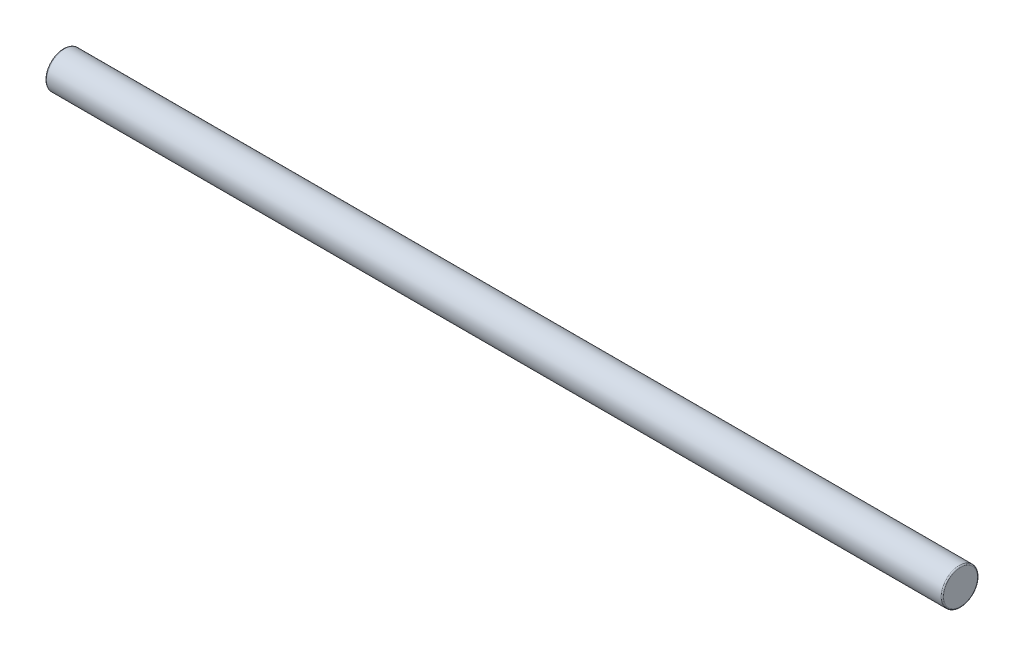
ISO-10303-21;
HEADER;
FILE_DESCRIPTION(('STEP AP214'),'2;1');
FILE_NAME('part.step','',(''),(''),'','','');
FILE_SCHEMA(('AUTOMOTIVE_DESIGN { 1 0 10303 214 1 1 1 1 }'));
ENDSEC;
DATA;
#1=APPLICATION_CONTEXT('core data for automotive mechanical design processes');
#2=APPLICATION_PROTOCOL_DEFINITION('international standard','automotive_design',2000,#1);
#3=PRODUCT_CONTEXT('',#1,'mechanical');
#4=PRODUCT('Part','Part','',(#3));
#5=PRODUCT_RELATED_PRODUCT_CATEGORY('part','',(#4));
#6=PRODUCT_DEFINITION_FORMATION('','',#4);
#7=PRODUCT_DEFINITION_CONTEXT('part definition',#1,'design');
#8=PRODUCT_DEFINITION('design','',#6,#7);
#9=PRODUCT_DEFINITION_SHAPE('','',#8);
#10=(LENGTH_UNIT() NAMED_UNIT(*) SI_UNIT(.MILLI.,.METRE.));
#11=(NAMED_UNIT(*) PLANE_ANGLE_UNIT() SI_UNIT($,.RADIAN.));
#12=(NAMED_UNIT(*) SI_UNIT($,.STERADIAN.) SOLID_ANGLE_UNIT());
#13=UNCERTAINTY_MEASURE_WITH_UNIT(LENGTH_MEASURE(1.E-05),#10,'distance_accuracy_value','');
#14=(GEOMETRIC_REPRESENTATION_CONTEXT(3) GLOBAL_UNCERTAINTY_ASSIGNED_CONTEXT((#13)) GLOBAL_UNIT_ASSIGNED_CONTEXT((#10,
#11,#12)) REPRESENTATION_CONTEXT('',''));
#15=CARTESIAN_POINT('',(0.,0.,0.));
#16=DIRECTION('',(0.,0.,1.));
#17=DIRECTION('',(1.,0.,0.));
#18=AXIS2_PLACEMENT_3D('',#15,#16,#17);
#19=CARTESIAN_POINT('',(18.796,0.,0.));
#20=DIRECTION('',(-1.,0.,0.));
#21=DIRECTION('',(0.,0.,1.));
#22=AXIS2_PLACEMENT_3D('',#19,#20,#21);
#23=CYLINDRICAL_SURFACE('',#22,0.380999999999999);
#24=CARTESIAN_POINT('',(0.0253999999999983,0.,0.));
#25=DIRECTION('',(1.,0.,0.));
#26=DIRECTION('',(0.,0.,-1.));
#27=AXIS2_PLACEMENT_3D('',#24,#25,#26);
#28=CIRCLE('',#27,0.380999999999999);
#29=CARTESIAN_POINT('',(0.0253999999999983,0.,-0.380999999999999));
#30=VERTEX_POINT('',#29);
#31=EDGE_CURVE('E41',#30,#30,#28,.T.);
#32=ORIENTED_EDGE('',*,*,#31,.T.);
#33=EDGE_LOOP('',(#32));
#34=FACE_BOUND('',#33,.T.);
#35=CARTESIAN_POINT('',(18.7706,0.,0.));
#36=DIRECTION('',(1.,0.,0.));
#37=DIRECTION('',(0.,0.,-1.));
#38=AXIS2_PLACEMENT_3D('',#35,#36,#37);
#39=CIRCLE('',#38,0.380999999999999);
#40=CARTESIAN_POINT('',(18.7706,0.,-0.380999999999999));
#41=VERTEX_POINT('',#40);
#42=EDGE_CURVE('E45',#41,#41,#39,.F.);
#43=ORIENTED_EDGE('',*,*,#42,.T.);
#44=EDGE_LOOP('',(#43));
#45=FACE_BOUND('',#44,.T.);
#46=ADVANCED_FACE('F30',(#34,#45),#23,.T.);
#47=CARTESIAN_POINT('',(18.796,0.,0.));
#48=DIRECTION('',(1.,0.,0.));
#49=DIRECTION('',(0.,0.,-1.));
#50=AXIS2_PLACEMENT_3D('',#47,#48,#49);
#51=PLANE('',#50);
#52=CARTESIAN_POINT('',(18.796,0.,0.));
#53=DIRECTION('',(1.,0.,0.));
#54=DIRECTION('',(0.,0.,-1.));
#55=AXIS2_PLACEMENT_3D('',#52,#53,#54);
#56=CIRCLE('',#55,0.355599999999999);
#57=CARTESIAN_POINT('',(18.796,0.,-0.355599999999999));
#58=VERTEX_POINT('',#57);
#59=EDGE_CURVE('E10',#58,#58,#56,.T.);
#60=ORIENTED_EDGE('',*,*,#59,.T.);
#61=EDGE_LOOP('',(#60));
#62=FACE_BOUND('',#61,.T.);
#63=ADVANCED_FACE('F61',(#62),#51,.T.);
#64=CARTESIAN_POINT('',(0.,0.,0.));
#65=DIRECTION('',(1.,0.,0.));
#66=DIRECTION('',(0.,0.,-1.));
#67=AXIS2_PLACEMENT_3D('',#64,#65,#66);
#68=PLANE('',#67);
#69=CARTESIAN_POINT('',(0.,0.,0.));
#70=DIRECTION('',(1.,0.,0.));
#71=DIRECTION('',(0.,0.,-1.));
#72=AXIS2_PLACEMENT_3D('',#69,#70,#71);
#73=CIRCLE('',#72,0.355599999999999);
#74=CARTESIAN_POINT('',(0.,0.,-0.355599999999999));
#75=VERTEX_POINT('',#74);
#76=EDGE_CURVE('E37',#75,#75,#73,.F.);
#77=ORIENTED_EDGE('',*,*,#76,.T.);
#78=EDGE_LOOP('',(#77));
#79=FACE_BOUND('',#78,.T.);
#80=ADVANCED_FACE('F58',(#79),#68,.F.);
#81=CARTESIAN_POINT('',(0.0253999999999983,0.,0.));
#82=DIRECTION('',(1.,0.,0.));
#83=DIRECTION('',(0.,0.,-1.));
#84=AXIS2_PLACEMENT_3D('',#81,#82,#83);
#85=TOROIDAL_SURFACE('',#84,0.355599999999999,0.0254);
#86=ORIENTED_EDGE('',*,*,#76,.F.);
#87=EDGE_LOOP('',(#86));
#88=FACE_BOUND('',#87,.T.);
#89=ORIENTED_EDGE('',*,*,#31,.F.);
#90=EDGE_LOOP('',(#89));
#91=FACE_BOUND('',#90,.T.);
#92=ADVANCED_FACE('F54',(#88,#91),#85,.T.);
#93=CARTESIAN_POINT('',(18.7706,0.,0.));
#94=DIRECTION('',(1.,0.,0.));
#95=DIRECTION('',(0.,0.,-1.));
#96=AXIS2_PLACEMENT_3D('',#93,#94,#95);
#97=TOROIDAL_SURFACE('',#96,0.355599999999999,0.0254);
#98=ORIENTED_EDGE('',*,*,#42,.F.);
#99=EDGE_LOOP('',(#98));
#100=FACE_BOUND('',#99,.T.);
#101=ORIENTED_EDGE('',*,*,#59,.F.);
#102=EDGE_LOOP('',(#101));
#103=FACE_BOUND('',#102,.T.);
#104=ADVANCED_FACE('F32',(#100,#103),#97,.T.);
#105=CLOSED_SHELL('',(#46,#63,#80,#92,#104));
#106=MANIFOLD_SOLID_BREP('B2',#105);
#107=ADVANCED_BREP_SHAPE_REPRESENTATION('',(#18,#106),#14);
#108=SHAPE_DEFINITION_REPRESENTATION(#9,#107);
ENDSEC;
END-ISO-10303-21;
